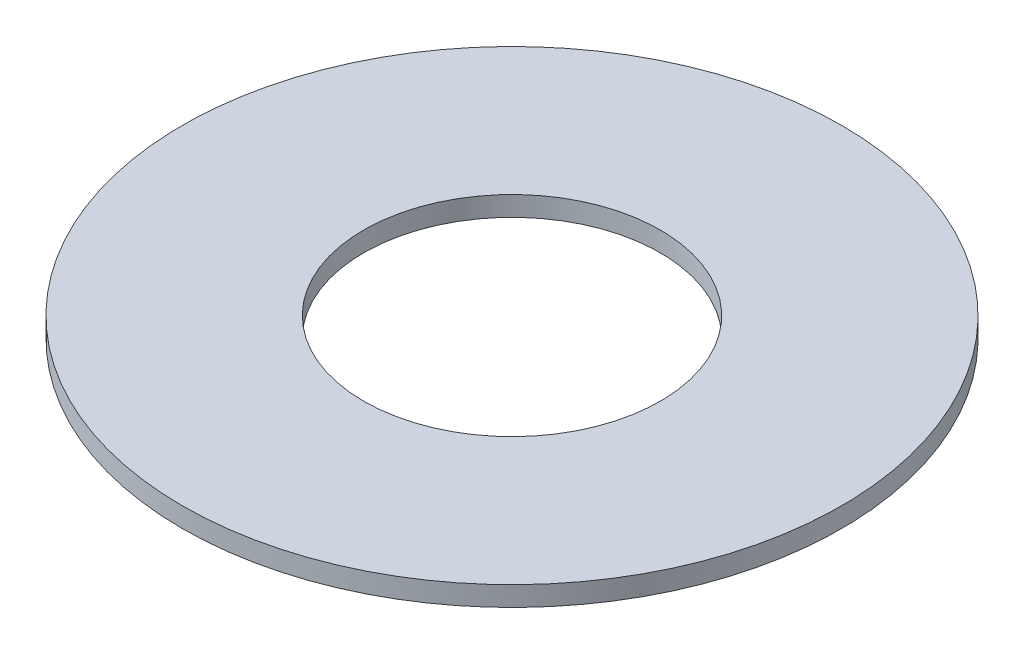
ISO-10303-21;
HEADER;
FILE_DESCRIPTION(('STEP AP214'),'2;1');
FILE_NAME('part.step','',(''),(''),'','','');
FILE_SCHEMA(('AUTOMOTIVE_DESIGN { 1 0 10303 214 1 1 1 1 }'));
ENDSEC;
DATA;
#1=APPLICATION_CONTEXT('core data for automotive mechanical design processes');
#2=APPLICATION_PROTOCOL_DEFINITION('international standard','automotive_design',2000,#1);
#3=PRODUCT_CONTEXT('',#1,'mechanical');
#4=PRODUCT('Part','Part','',(#3));
#5=PRODUCT_RELATED_PRODUCT_CATEGORY('part','',(#4));
#6=PRODUCT_DEFINITION_FORMATION('','',#4);
#7=PRODUCT_DEFINITION_CONTEXT('part definition',#1,'design');
#8=PRODUCT_DEFINITION('design','',#6,#7);
#9=PRODUCT_DEFINITION_SHAPE('','',#8);
#10=(LENGTH_UNIT() NAMED_UNIT(*) SI_UNIT(.MILLI.,.METRE.));
#11=(NAMED_UNIT(*) PLANE_ANGLE_UNIT() SI_UNIT($,.RADIAN.));
#12=(NAMED_UNIT(*) SI_UNIT($,.STERADIAN.) SOLID_ANGLE_UNIT());
#13=UNCERTAINTY_MEASURE_WITH_UNIT(LENGTH_MEASURE(1.E-05),#10,'distance_accuracy_value','');
#14=(GEOMETRIC_REPRESENTATION_CONTEXT(3) GLOBAL_UNCERTAINTY_ASSIGNED_CONTEXT((#13)) GLOBAL_UNIT_ASSIGNED_CONTEXT((#10,
#11,#12)) REPRESENTATION_CONTEXT('',''));
#15=CARTESIAN_POINT('',(0.,0.,0.));
#16=DIRECTION('',(0.,0.,1.));
#17=DIRECTION('',(1.,0.,0.));
#18=AXIS2_PLACEMENT_3D('',#15,#16,#17);
#19=CARTESIAN_POINT('',(0.,6.,0.));
#20=DIRECTION('',(0.,-1.,0.));
#21=DIRECTION('',(0.,0.,-1.));
#22=AXIS2_PLACEMENT_3D('',#19,#20,#21);
#23=CYLINDRICAL_SURFACE('',#22,100.);
#24=CARTESIAN_POINT('',(0.,6.,0.));
#25=DIRECTION('',(0.,1.,0.));
#26=DIRECTION('',(0.,0.,1.));
#27=AXIS2_PLACEMENT_3D('',#24,#25,#26);
#28=CIRCLE('',#27,100.);
#29=CARTESIAN_POINT('',(0.,6.,100.));
#30=VERTEX_POINT('',#29);
#31=EDGE_CURVE('E10',#30,#30,#28,.T.);
#32=ORIENTED_EDGE('',*,*,#31,.F.);
#33=EDGE_LOOP('',(#32));
#34=FACE_BOUND('',#33,.T.);
#35=CARTESIAN_POINT('',(0.,0.,0.));
#36=DIRECTION('',(0.,1.,0.));
#37=DIRECTION('',(0.,0.,1.));
#38=AXIS2_PLACEMENT_3D('',#35,#36,#37);
#39=CIRCLE('',#38,100.);
#40=CARTESIAN_POINT('',(0.,0.,100.));
#41=VERTEX_POINT('',#40);
#42=EDGE_CURVE('E37',#41,#41,#39,.T.);
#43=ORIENTED_EDGE('',*,*,#42,.T.);
#44=EDGE_LOOP('',(#43));
#45=FACE_BOUND('',#44,.T.);
#46=ADVANCED_FACE('F40',(#34,#45),#23,.T.);
#47=CARTESIAN_POINT('',(0.,6.,0.));
#48=DIRECTION('',(0.,1.,0.));
#49=DIRECTION('',(0.,0.,1.));
#50=AXIS2_PLACEMENT_3D('',#47,#48,#49);
#51=PLANE('',#50);
#52=CARTESIAN_POINT('',(0.,6.,0.));
#53=DIRECTION('',(0.,1.,0.));
#54=DIRECTION('',(0.,0.,1.));
#55=AXIS2_PLACEMENT_3D('',#52,#53,#54);
#56=CIRCLE('',#55,45.);
#57=CARTESIAN_POINT('',(0.,6.,45.));
#58=VERTEX_POINT('',#57);
#59=EDGE_CURVE('E50',#58,#58,#56,.T.);
#60=ORIENTED_EDGE('',*,*,#59,.F.);
#61=EDGE_LOOP('',(#60));
#62=FACE_BOUND('',#61,.T.);
#63=ORIENTED_EDGE('',*,*,#31,.T.);
#64=EDGE_LOOP('',(#63));
#65=FACE_BOUND('',#64,.T.);
#66=ADVANCED_FACE('F59',(#62,#65),#51,.T.);
#67=CARTESIAN_POINT('',(0.,0.,0.));
#68=DIRECTION('',(0.,1.,0.));
#69=DIRECTION('',(0.,0.,1.));
#70=AXIS2_PLACEMENT_3D('',#67,#68,#69);
#71=PLANE('',#70);
#72=CARTESIAN_POINT('',(0.,0.,0.));
#73=DIRECTION('',(0.,1.,0.));
#74=DIRECTION('',(0.,0.,1.));
#75=AXIS2_PLACEMENT_3D('',#72,#73,#74);
#76=CIRCLE('',#75,45.);
#77=CARTESIAN_POINT('',(0.,0.,45.));
#78=VERTEX_POINT('',#77);
#79=EDGE_CURVE('E47',#78,#78,#76,.T.);
#80=ORIENTED_EDGE('',*,*,#79,.T.);
#81=EDGE_LOOP('',(#80));
#82=FACE_BOUND('',#81,.T.);
#83=ORIENTED_EDGE('',*,*,#42,.F.);
#84=EDGE_LOOP('',(#83));
#85=FACE_BOUND('',#84,.T.);
#86=ADVANCED_FACE('F58',(#82,#85),#71,.F.);
#87=CARTESIAN_POINT('',(0.,6.,0.));
#88=DIRECTION('',(0.,-1.,0.));
#89=DIRECTION('',(0.,0.,-1.));
#90=AXIS2_PLACEMENT_3D('',#87,#88,#89);
#91=CYLINDRICAL_SURFACE('',#90,45.);
#92=ORIENTED_EDGE('',*,*,#59,.T.);
#93=EDGE_LOOP('',(#92));
#94=FACE_BOUND('',#93,.T.);
#95=ORIENTED_EDGE('',*,*,#79,.F.);
#96=EDGE_LOOP('',(#95));
#97=FACE_BOUND('',#96,.T.);
#98=ADVANCED_FACE('F54',(#94,#97),#91,.F.);
#99=CLOSED_SHELL('',(#46,#66,#86,#98));
#100=MANIFOLD_SOLID_BREP('B2',#99);
#101=ADVANCED_BREP_SHAPE_REPRESENTATION('',(#18,#100),#14);
#102=SHAPE_DEFINITION_REPRESENTATION(#9,#101);
ENDSEC;
END-ISO-10303-21;
